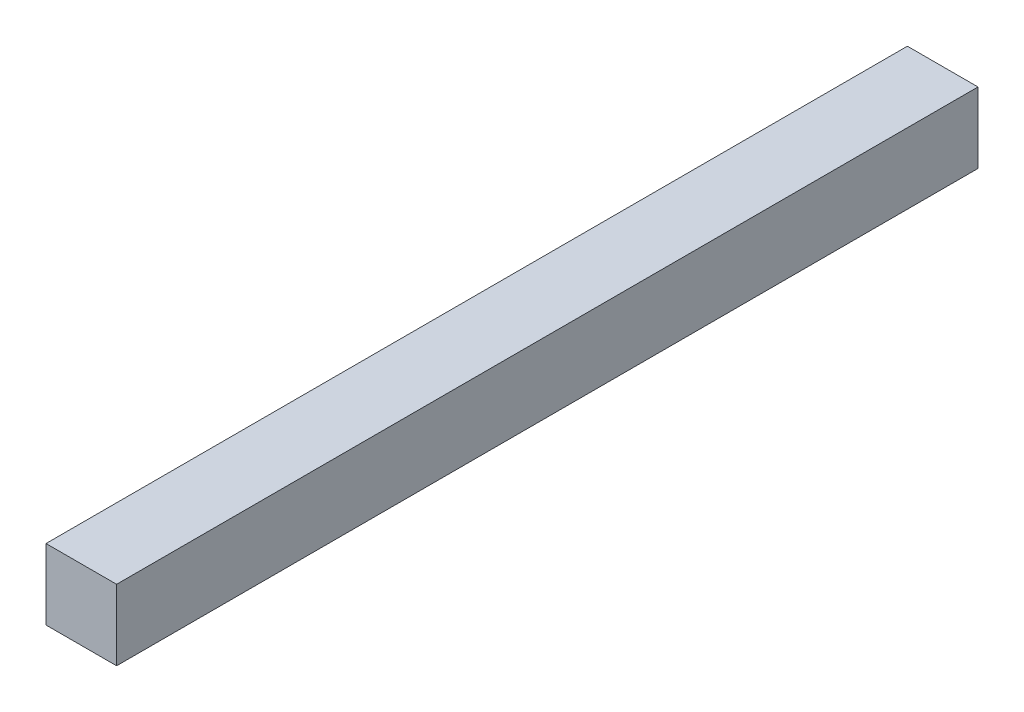
ISO-10303-21;
HEADER;
FILE_DESCRIPTION(('STEP AP214'),'2;1');
FILE_NAME('part.step','',(''),(''),'','','');
FILE_SCHEMA(('AUTOMOTIVE_DESIGN { 1 0 10303 214 1 1 1 1 }'));
ENDSEC;
DATA;
#1=APPLICATION_CONTEXT('core data for automotive mechanical design processes');
#2=APPLICATION_PROTOCOL_DEFINITION('international standard','automotive_design',2000,#1);
#3=PRODUCT_CONTEXT('',#1,'mechanical');
#4=PRODUCT('Part','Part','',(#3));
#5=PRODUCT_RELATED_PRODUCT_CATEGORY('part','',(#4));
#6=PRODUCT_DEFINITION_FORMATION('','',#4);
#7=PRODUCT_DEFINITION_CONTEXT('part definition',#1,'design');
#8=PRODUCT_DEFINITION('design','',#6,#7);
#9=PRODUCT_DEFINITION_SHAPE('','',#8);
#10=(LENGTH_UNIT() NAMED_UNIT(*) SI_UNIT(.MILLI.,.METRE.));
#11=(NAMED_UNIT(*) PLANE_ANGLE_UNIT() SI_UNIT($,.RADIAN.));
#12=(NAMED_UNIT(*) SI_UNIT($,.STERADIAN.) SOLID_ANGLE_UNIT());
#13=UNCERTAINTY_MEASURE_WITH_UNIT(LENGTH_MEASURE(1.E-05),#10,'distance_accuracy_value','');
#14=(GEOMETRIC_REPRESENTATION_CONTEXT(3) GLOBAL_UNCERTAINTY_ASSIGNED_CONTEXT((#13)) GLOBAL_UNIT_ASSIGNED_CONTEXT((#10,
#11,#12)) REPRESENTATION_CONTEXT('',''));
#15=CARTESIAN_POINT('',(0.,0.,0.));
#16=DIRECTION('',(0.,0.,1.));
#17=DIRECTION('',(1.,0.,0.));
#18=AXIS2_PLACEMENT_3D('',#15,#16,#17);
#19=CARTESIAN_POINT('',(-5.,5.,122.));
#20=DIRECTION('',(1.,0.,0.));
#21=DIRECTION('',(0.,1.,0.));
#22=AXIS2_PLACEMENT_3D('',#19,#20,#21);
#23=PLANE('',#22);
#24=DIRECTION('',(0.,-1.,0.));
#25=VECTOR('',#24,1.);
#26=CARTESIAN_POINT('',(-5.,5.,0.));
#27=LINE('',#26,#25);
#28=CARTESIAN_POINT('',(-5.,5.,0.));
#29=VERTEX_POINT('',#28);
#30=CARTESIAN_POINT('',(-5.,-5.,0.));
#31=VERTEX_POINT('',#30);
#32=EDGE_CURVE('E104',#29,#31,#27,.T.);
#33=ORIENTED_EDGE('',*,*,#32,.T.);
#34=DIRECTION('',(0.,0.,-1.));
#35=VECTOR('',#34,1.);
#36=CARTESIAN_POINT('',(-5.,-5.,122.));
#37=LINE('',#36,#35);
#38=CARTESIAN_POINT('',(-5.,-5.,122.));
#39=VERTEX_POINT('',#38);
#40=EDGE_CURVE('E11',#39,#31,#37,.T.);
#41=ORIENTED_EDGE('',*,*,#40,.F.);
#42=DIRECTION('',(0.,-1.,0.));
#43=VECTOR('',#42,1.);
#44=CARTESIAN_POINT('',(-5.,5.,122.));
#45=LINE('',#44,#43);
#46=CARTESIAN_POINT('',(-5.,5.,122.));
#47=VERTEX_POINT('',#46);
#48=EDGE_CURVE('E91',#47,#39,#45,.T.);
#49=ORIENTED_EDGE('',*,*,#48,.F.);
#50=DIRECTION('',(0.,0.,-1.));
#51=VECTOR('',#50,1.);
#52=CARTESIAN_POINT('',(-5.,5.,122.));
#53=LINE('',#52,#51);
#54=EDGE_CURVE('E100',#47,#29,#53,.T.);
#55=ORIENTED_EDGE('',*,*,#54,.T.);
#56=EDGE_LOOP('',(#33,#41,#49,#55));
#57=FACE_BOUND('',#56,.T.);
#58=ADVANCED_FACE('F34',(#57),#23,.F.);
#59=CARTESIAN_POINT('',(-5.,-5.,122.));
#60=DIRECTION('',(0.,1.,0.));
#61=DIRECTION('',(0.,0.,1.));
#62=AXIS2_PLACEMENT_3D('',#59,#60,#61);
#63=PLANE('',#62);
#64=CARTESIAN_POINT('',(0.,-5.,6.23142726504401));
#65=DIRECTION('',(0.,-1.,0.));
#66=DIRECTION('',(0.,0.,-1.));
#67=AXIS2_PLACEMENT_3D('',#64,#65,#66);
#68=CIRCLE('',#67,2.);
#69=CARTESIAN_POINT('',(0.,-5.,4.23142726504401));
#70=VERTEX_POINT('',#69);
#71=EDGE_CURVE('E123',#70,#70,#68,.T.);
#72=ORIENTED_EDGE('',*,*,#71,.F.);
#73=EDGE_LOOP('',(#72));
#74=FACE_BOUND('',#73,.T.);
#75=DIRECTION('',(1.,0.,0.));
#76=VECTOR('',#75,1.);
#77=CARTESIAN_POINT('',(-5.,-5.,0.));
#78=LINE('',#77,#76);
#79=CARTESIAN_POINT('',(5.,-5.,0.));
#80=VERTEX_POINT('',#79);
#81=EDGE_CURVE('E95',#31,#80,#78,.T.);
#82=ORIENTED_EDGE('',*,*,#81,.T.);
#83=DIRECTION('',(0.,0.,-1.));
#84=VECTOR('',#83,1.);
#85=CARTESIAN_POINT('',(5.,-5.,122.));
#86=LINE('',#85,#84);
#87=CARTESIAN_POINT('',(5.,-5.,122.));
#88=VERTEX_POINT('',#87);
#89=EDGE_CURVE('E48',#88,#80,#86,.T.);
#90=ORIENTED_EDGE('',*,*,#89,.F.);
#91=DIRECTION('',(1.,0.,0.));
#92=VECTOR('',#91,1.);
#93=CARTESIAN_POINT('',(-5.,-5.,122.));
#94=LINE('',#93,#92);
#95=EDGE_CURVE('E86',#39,#88,#94,.T.);
#96=ORIENTED_EDGE('',*,*,#95,.F.);
#97=ORIENTED_EDGE('',*,*,#40,.T.);
#98=EDGE_LOOP('',(#82,#90,#96,#97));
#99=FACE_BOUND('',#98,.T.);
#100=ADVANCED_FACE('F94',(#74,#99),#63,.F.);
#101=CARTESIAN_POINT('',(5.,5.,122.));
#102=DIRECTION('',(-1.,0.,0.));
#103=DIRECTION('',(0.,-1.,0.));
#104=AXIS2_PLACEMENT_3D('',#101,#102,#103);
#105=PLANE('',#104);
#106=DIRECTION('',(0.,1.,0.));
#107=VECTOR('',#106,1.);
#108=CARTESIAN_POINT('',(5.,5.,0.));
#109=LINE('',#108,#107);
#110=CARTESIAN_POINT('',(5.,5.,0.));
#111=VERTEX_POINT('',#110);
#112=EDGE_CURVE('E73',#80,#111,#109,.T.);
#113=ORIENTED_EDGE('',*,*,#112,.T.);
#114=DIRECTION('',(0.,0.,-1.));
#115=VECTOR('',#114,1.);
#116=CARTESIAN_POINT('',(5.,5.,122.));
#117=LINE('',#116,#115);
#118=CARTESIAN_POINT('',(5.,5.,122.));
#119=VERTEX_POINT('',#118);
#120=EDGE_CURVE('E96',#119,#111,#117,.T.);
#121=ORIENTED_EDGE('',*,*,#120,.F.);
#122=DIRECTION('',(0.,1.,0.));
#123=VECTOR('',#122,1.);
#124=CARTESIAN_POINT('',(5.,5.,122.));
#125=LINE('',#124,#123);
#126=EDGE_CURVE('E89',#88,#119,#125,.T.);
#127=ORIENTED_EDGE('',*,*,#126,.F.);
#128=ORIENTED_EDGE('',*,*,#89,.T.);
#129=EDGE_LOOP('',(#113,#121,#127,#128));
#130=FACE_BOUND('',#129,.T.);
#131=ADVANCED_FACE('F98',(#130),#105,.F.);
#132=CARTESIAN_POINT('',(-5.,5.,122.));
#133=DIRECTION('',(0.,-1.,0.));
#134=DIRECTION('',(0.,0.,-1.));
#135=AXIS2_PLACEMENT_3D('',#132,#133,#134);
#136=PLANE('',#135);
#137=DIRECTION('',(-1.,0.,0.));
#138=VECTOR('',#137,1.);
#139=CARTESIAN_POINT('',(-5.,5.,0.));
#140=LINE('',#139,#138);
#141=EDGE_CURVE('E79',#111,#29,#140,.T.);
#142=ORIENTED_EDGE('',*,*,#141,.T.);
#143=ORIENTED_EDGE('',*,*,#54,.F.);
#144=DIRECTION('',(-1.,0.,0.));
#145=VECTOR('',#144,1.);
#146=CARTESIAN_POINT('',(-5.,5.,122.));
#147=LINE('',#146,#145);
#148=EDGE_CURVE('E56',#119,#47,#147,.T.);
#149=ORIENTED_EDGE('',*,*,#148,.F.);
#150=ORIENTED_EDGE('',*,*,#120,.T.);
#151=EDGE_LOOP('',(#142,#143,#149,#150));
#152=FACE_BOUND('',#151,.T.);
#153=ADVANCED_FACE('F112',(#152),#136,.F.);
#154=CARTESIAN_POINT('',(0.,0.,122.));
#155=DIRECTION('',(0.,0.,1.));
#156=DIRECTION('',(1.,0.,0.));
#157=AXIS2_PLACEMENT_3D('',#154,#155,#156);
#158=PLANE('',#157);
#159=ORIENTED_EDGE('',*,*,#48,.T.);
#160=ORIENTED_EDGE('',*,*,#95,.T.);
#161=ORIENTED_EDGE('',*,*,#126,.T.);
#162=ORIENTED_EDGE('',*,*,#148,.T.);
#163=EDGE_LOOP('',(#159,#160,#161,#162));
#164=FACE_BOUND('',#163,.T.);
#165=ADVANCED_FACE('F87',(#164),#158,.T.);
#166=CARTESIAN_POINT('',(0.,0.,0.));
#167=DIRECTION('',(0.,0.,1.));
#168=DIRECTION('',(1.,0.,0.));
#169=AXIS2_PLACEMENT_3D('',#166,#167,#168);
#170=PLANE('',#169);
#171=CARTESIAN_POINT('',(0.,0.,0.));
#172=DIRECTION('',(0.,0.,-1.));
#173=DIRECTION('',(-1.,0.,0.));
#174=AXIS2_PLACEMENT_3D('',#171,#172,#173);
#175=CIRCLE('',#174,4.);
#176=CARTESIAN_POINT('',(-4.,0.,0.));
#177=VERTEX_POINT('',#176);
#178=EDGE_CURVE('E118',#177,#177,#175,.T.);
#179=ORIENTED_EDGE('',*,*,#178,.F.);
#180=EDGE_LOOP('',(#179));
#181=FACE_BOUND('',#180,.T.);
#182=ORIENTED_EDGE('',*,*,#32,.F.);
#183=ORIENTED_EDGE('',*,*,#141,.F.);
#184=ORIENTED_EDGE('',*,*,#112,.F.);
#185=ORIENTED_EDGE('',*,*,#81,.F.);
#186=EDGE_LOOP('',(#182,#183,#184,#185));
#187=FACE_BOUND('',#186,.T.);
#188=ADVANCED_FACE('F115',(#181,#187),#170,.F.);
#189=CARTESIAN_POINT('',(0.,0.,120.));
#190=DIRECTION('',(0.,0.,-1.));
#191=DIRECTION('',(-1.,0.,0.));
#192=AXIS2_PLACEMENT_3D('',#189,#190,#191);
#193=CYLINDRICAL_SURFACE('',#192,4.);
#194=CARTESIAN_POINT('',(0.,-4.,4.23142726504401));
#195=CARTESIAN_POINT('',(0.105143925902467,-3.99999426810082,4.23143386967839));
#196=CARTESIAN_POINT('',(0.210413199395125,-3.99580982039513,4.23976741128612));
#197=CARTESIAN_POINT('',(0.417840470537792,-3.97948312074314,4.27273302572708));
#198=CARTESIAN_POINT('',(0.519992173427259,-3.96732575657839,4.29739605103964));
#199=CARTESIAN_POINT('',(0.717867089760898,-3.93632558806751,4.36181488227727));
#200=CARTESIAN_POINT('',(0.813613605878292,-3.91750878355075,4.40151203353994));
#201=CARTESIAN_POINT('',(0.996945233613197,-3.87491553031523,4.49456850777398));
#202=CARTESIAN_POINT('',(1.08453098798012,-3.85113947267051,4.54792675354174));
#203=CARTESIAN_POINT('',(1.25501563552382,-3.79912516516124,4.67046176401458));
#204=CARTESIAN_POINT('',(1.33731042224422,-3.77070398255074,4.74040022352329));
#205=CARTESIAN_POINT('',(1.48955888973396,-3.71319940493486,4.89247022353808));
#206=CARTESIAN_POINT('',(1.55950316621353,-3.68411552418069,4.97461096858889));
#207=CARTESIAN_POINT('',(1.69050400090056,-3.62597902394695,5.15639396409077));
#208=CARTESIAN_POINT('',(1.75045067110327,-3.59710373940264,5.25689946173583));
#209=CARTESIAN_POINT('',(1.85233645378139,-3.54571957544641,5.46816193701644));
#210=CARTESIAN_POINT('',(1.89428842993267,-3.52320615213979,5.57891152248951));
#211=CARTESIAN_POINT('',(1.95626488437718,-3.48915734075617,5.80075747588785));
#212=CARTESIAN_POINT('',(1.97745171416088,-3.47704543167427,5.9114361691788));
#213=CARTESIAN_POINT('',(2.00085398661769,-3.46363779897055,6.13538494060296));
#214=CARTESIAN_POINT('',(2.00308817674615,-3.46233138686576,6.24865234678632));
#215=CARTESIAN_POINT('',(1.98937457434459,-3.47021860514497,6.45999931367475));
#216=CARTESIAN_POINT('',(1.97556911907364,-3.47817527324027,6.55827532749011));
#217=CARTESIAN_POINT('',(1.93387969811386,-3.50152457467701,6.75087108379009));
#218=CARTESIAN_POINT('',(1.9059912477953,-3.51691957663553,6.84518955565464));
#219=CARTESIAN_POINT('',(1.83641956077201,-3.55374952825482,7.02988553017533));
#220=CARTESIAN_POINT('',(1.79443013423199,-3.57531681327997,7.12012006261559));
#221=CARTESIAN_POINT('',(1.698083375336,-3.62206808562807,7.29269585022402));
#222=CARTESIAN_POINT('',(1.64372048762493,-3.64725369560381,7.37503353624419));
#223=CARTESIAN_POINT('',(1.51613210982558,-3.70226315806572,7.54046977053046));
#224=CARTESIAN_POINT('',(1.44138891673856,-3.73227020473492,7.62234101219632));
#225=CARTESIAN_POINT('',(1.27911115748275,-3.79095246600814,7.77289810222581));
#226=CARTESIAN_POINT('',(1.19157051314857,-3.81962703917602,7.84157764911177));
#227=CARTESIAN_POINT('',(1.0010330116637,-3.87403974565928,7.96679858710346));
#228=CARTESIAN_POINT('',(0.897507183198818,-3.89957968324014,8.02262820993549));
#229=CARTESIAN_POINT('',(0.680932430977593,-3.94315762242484,8.11562132313003));
#230=CARTESIAN_POINT('',(0.567891152530552,-3.96120157887106,8.15279963507434));
#231=CARTESIAN_POINT('',(0.345532983321404,-3.98648667482871,8.20437807247736));
#232=CARTESIAN_POINT('',(0.236683061096652,-3.9944987660262,8.22040973653757));
#233=CARTESIAN_POINT('',(0.0175591998987034,-4.00146026918207,8.23435672731298));
#234=CARTESIAN_POINT('',(-0.0927140397398171,-4.00041397442637,8.23228063632295));
#235=CARTESIAN_POINT('',(-0.302465943971973,-3.9898238450687,8.21101388820652));
#236=CARTESIAN_POINT('',(-0.40211881609986,-3.98094491376337,8.19316219958402));
#237=CARTESIAN_POINT('',(-0.596813784603882,-3.95644342629681,8.14295112125377));
#238=CARTESIAN_POINT('',(-0.691855371382173,-3.94082012668824,8.11059013213702));
#239=CARTESIAN_POINT('',(-0.877777216899145,-3.90368502827176,8.03143033217794));
#240=CARTESIAN_POINT('',(-0.968460794011607,-3.88201763539262,7.98424516481143));
#241=CARTESIAN_POINT('',(-1.14092272339854,-3.83487948634835,7.87721219375087));
#242=CARTESIAN_POINT('',(-1.22269725955318,-3.80940711133877,7.81735899585322));
#243=CARTESIAN_POINT('',(-1.38353537857843,-3.75416442672396,7.67990641438258));
#244=CARTESIAN_POINT('',(-1.46154415563805,-3.72421769686998,7.60114152815371));
#245=CARTESIAN_POINT('',(-1.60371264223771,-3.6652478321764,7.43157696248855));
#246=CARTESIAN_POINT('',(-1.66786277142375,-3.63622534800094,7.34076902734817));
#247=CARTESIAN_POINT('',(-1.78341582895804,-3.58102384412979,7.14413995669806));
#248=CARTESIAN_POINT('',(-1.8340509916005,-3.55505059178121,7.03780473285505));
#249=CARTESIAN_POINT('',(-1.91616565186941,-3.51148144588269,6.81640712989408));
#250=CARTESIAN_POINT('',(-1.94766983173403,-3.493874764435,6.70135621211023));
#251=CARTESIAN_POINT('',(-1.98772337493374,-3.47123002051604,6.4776068192746));
#252=CARTESIAN_POINT('',(-1.9981859928109,-3.4651476693013,6.36935875817353));
#253=CARTESIAN_POINT('',(-2.0013783087524,-3.46330709283206,6.15253313071496));
#254=CARTESIAN_POINT('',(-1.99411569324648,-3.4675443925278,6.04395572756829));
#255=CARTESIAN_POINT('',(-1.96385225118662,-3.48475724102153,5.84046026197714));
#256=CARTESIAN_POINT('',(-1.94241662868607,-3.49686188965317,5.74522632475453));
#257=CARTESIAN_POINT('',(-1.88635071644882,-3.52742032375305,5.55981102619528));
#258=CARTESIAN_POINT('',(-1.85171618231984,-3.54587615139337,5.46963130085995));
#259=CARTESIAN_POINT('',(-1.76763149060113,-3.58857060729071,5.29017756307093));
#260=CARTESIAN_POINT('',(-1.7173422756314,-3.61311444791841,5.20137146138595));
#261=CARTESIAN_POINT('',(-1.60430194327478,-3.66470663269721,5.03287819268149));
#262=CARTESIAN_POINT('',(-1.54154434248312,-3.69175627591221,4.95319580400179));
#263=CARTESIAN_POINT('',(-1.39640665332275,-3.74924646316184,4.79514330033466));
#264=CARTESIAN_POINT('',(-1.31256884599452,-3.77969966613256,4.71810906034343));
#265=CARTESIAN_POINT('',(-1.13230961246639,-3.83755504519861,4.57890129817347));
#266=CARTESIAN_POINT('',(-1.03588144661039,-3.8649555725239,4.5167357861042));
#267=CARTESIAN_POINT('',(-0.831863193565891,-3.91396019133075,4.40895453961987));
#268=CARTESIAN_POINT('',(-0.72419900755346,-3.93552192987866,4.36345892657107));
#269=CARTESIAN_POINT('',(-0.501484202276172,-3.97002682597974,4.29181092952919));
#270=CARTESIAN_POINT('',(-0.386455599178199,-3.98299446726136,4.26560357143258));
#271=CARTESIAN_POINT('',(-0.22520389298179,-3.99390923826956,4.24363244287253));
#272=CARTESIAN_POINT('',(-0.180323758883129,-3.99618730680502,4.23906198331133));
#273=CARTESIAN_POINT('',(-0.090303463610183,-3.99923393953631,4.23295793401584));
#274=CARTESIAN_POINT('',(-0.0451632952932568,-4.00000246206762,4.23142442810359));
#275=CARTESIAN_POINT('',(0.,-4.,4.23142726504401));
#276=B_SPLINE_CURVE_WITH_KNOTS('',3,(#194,#195,#196,#197,#198,#199,#200,#201,#202,#203,#204,
#205,#206,#207,#208,#209,#210,#211,#212,#213,#214,#215,#216,#217,#218,#219,#220,#221,#222,#223,
#224,#225,#226,#227,#228,#229,#230,#231,#232,#233,#234,#235,#236,#237,#238,#239,#240,#241,#242,
#243,#244,#245,#246,#247,#248,#249,#250,#251,#252,#253,#254,#255,#256,#257,#258,#259,#260,#261,
#262,#263,#264,#265,#266,#267,#268,#269,#270,#271,#272,#273,#274,#275),.UNSPECIFIED.,.T.,.F.,(4,
2,2,2,2,2,2,2,2,2,2,2,2,2,2,2,2,2,2,2,2,2,2,2,2,2,2,2,2,2,2,2,2,2,2,2,2,2,2,2,4),(0.,
0.315248514840585,0.631096299418395,0.945724310984597,1.26032752116314,1.59396351743618,
1.92785247530807,2.28763452861505,2.64715895796562,2.98516024280459,3.32282714658041,
3.62011424818641,3.91749607851357,4.22180480336975,4.52625042520444,4.86929882667757,
5.21251069197373,5.57166044428881,5.93052433824559,6.25966580942691,6.58865129022952,
6.89213813012244,7.19565843261863,7.50785712055797,7.82018901496678,8.16319221288837,
8.50643177230863,8.86629364323451,9.22569023890901,9.55058615006093,9.87534119729357,
10.1691586049771,10.463070575767,10.7767291356057,11.0905512228726,11.4425048551434,
11.7946476676249,12.1492802732705,12.502898172423,12.6383056026783,12.7737167702213),.UNSPECIFIED.);
#277=CARTESIAN_POINT('',(0.,-4.,4.23142726504401));
#278=VERTEX_POINT('',#277);
#279=EDGE_CURVE('E37',#278,#278,#276,.T.);
#280=ORIENTED_EDGE('',*,*,#279,.T.);
#281=EDGE_LOOP('',(#280));
#282=FACE_BOUND('',#281,.T.);
#283=CARTESIAN_POINT('',(0.,0.,120.));
#284=DIRECTION('',(0.,0.,-1.));
#285=DIRECTION('',(-1.,0.,0.));
#286=AXIS2_PLACEMENT_3D('',#283,#284,#285);
#287=CIRCLE('',#286,4.);
#288=CARTESIAN_POINT('',(-4.,0.,120.));
#289=VERTEX_POINT('',#288);
#290=EDGE_CURVE('E107',#289,#289,#287,.T.);
#291=ORIENTED_EDGE('',*,*,#290,.F.);
#292=EDGE_LOOP('',(#291));
#293=FACE_BOUND('',#292,.T.);
#294=ORIENTED_EDGE('',*,*,#178,.T.);
#295=EDGE_LOOP('',(#294));
#296=FACE_BOUND('',#295,.T.);
#297=ADVANCED_FACE('F130',(#282,#293,#296),#193,.F.);
#298=CARTESIAN_POINT('',(0.,0.,120.));
#299=DIRECTION('',(0.,0.,-1.));
#300=DIRECTION('',(-1.,0.,0.));
#301=AXIS2_PLACEMENT_3D('',#298,#299,#300);
#302=PLANE('',#301);
#303=ORIENTED_EDGE('',*,*,#290,.T.);
#304=EDGE_LOOP('',(#303));
#305=FACE_BOUND('',#304,.T.);
#306=ADVANCED_FACE('F135',(#305),#302,.T.);
#307=CARTESIAN_POINT('',(0.,-3.,6.23142726504401));
#308=DIRECTION('',(0.,-1.,0.));
#309=DIRECTION('',(0.,0.,-1.));
#310=AXIS2_PLACEMENT_3D('',#307,#308,#309);
#311=CYLINDRICAL_SURFACE('',#310,2.);
#312=ORIENTED_EDGE('',*,*,#71,.T.);
#313=EDGE_LOOP('',(#312));
#314=FACE_BOUND('',#313,.T.);
#315=ORIENTED_EDGE('',*,*,#279,.F.);
#316=EDGE_LOOP('',(#315));
#317=FACE_BOUND('',#316,.T.);
#318=ADVANCED_FACE('F133',(#314,#317),#311,.F.);
#319=CLOSED_SHELL('',(#58,#100,#131,#153,#165,#188,#297,#306,#318));
#320=MANIFOLD_SOLID_BREP('B2',#319);
#321=ADVANCED_BREP_SHAPE_REPRESENTATION('',(#18,#320),#14);
#322=SHAPE_DEFINITION_REPRESENTATION(#9,#321);
ENDSEC;
END-ISO-10303-21;
